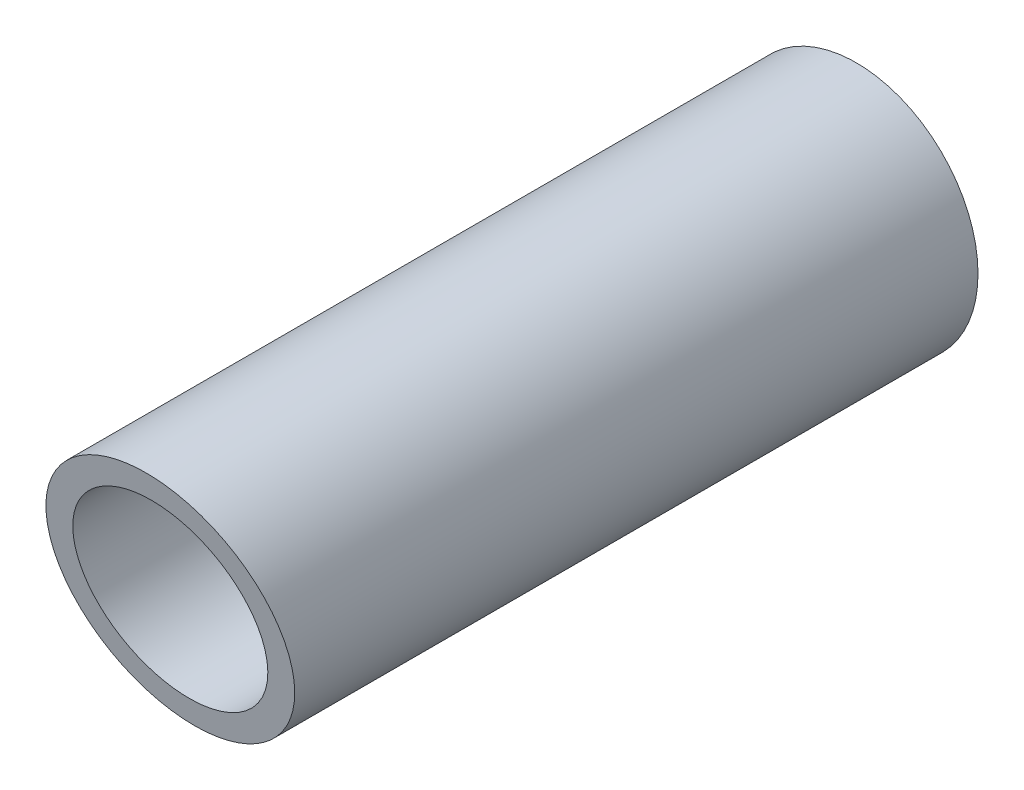
ISO-10303-21;
HEADER;
FILE_DESCRIPTION(('STEP AP214'),'2;1');
FILE_NAME('part.step','',(''),(''),'','','');
FILE_SCHEMA(('AUTOMOTIVE_DESIGN { 1 0 10303 214 1 1 1 1 }'));
ENDSEC;
DATA;
#1=APPLICATION_CONTEXT('core data for automotive mechanical design processes');
#2=APPLICATION_PROTOCOL_DEFINITION('international standard','automotive_design',2000,#1);
#3=PRODUCT_CONTEXT('',#1,'mechanical');
#4=PRODUCT('Part','Part','',(#3));
#5=PRODUCT_RELATED_PRODUCT_CATEGORY('part','',(#4));
#6=PRODUCT_DEFINITION_FORMATION('','',#4);
#7=PRODUCT_DEFINITION_CONTEXT('part definition',#1,'design');
#8=PRODUCT_DEFINITION('design','',#6,#7);
#9=PRODUCT_DEFINITION_SHAPE('','',#8);
#10=(LENGTH_UNIT() NAMED_UNIT(*) SI_UNIT(.MILLI.,.METRE.));
#11=(NAMED_UNIT(*) PLANE_ANGLE_UNIT() SI_UNIT($,.RADIAN.));
#12=(NAMED_UNIT(*) SI_UNIT($,.STERADIAN.) SOLID_ANGLE_UNIT());
#13=UNCERTAINTY_MEASURE_WITH_UNIT(LENGTH_MEASURE(1.E-05),#10,'distance_accuracy_value','');
#14=(GEOMETRIC_REPRESENTATION_CONTEXT(3) GLOBAL_UNCERTAINTY_ASSIGNED_CONTEXT((#13)) GLOBAL_UNIT_ASSIGNED_CONTEXT((#10,
#11,#12)) REPRESENTATION_CONTEXT('',''));
#15=CARTESIAN_POINT('',(0.,0.,0.));
#16=DIRECTION('',(0.,0.,1.));
#17=DIRECTION('',(1.,0.,0.));
#18=AXIS2_PLACEMENT_3D('',#15,#16,#17);
#19=CARTESIAN_POINT('',(0.,0.,0.));
#20=DIRECTION('',(0.,0.,1.));
#21=DIRECTION('',(1.,0.,0.));
#22=AXIS2_PLACEMENT_3D('',#19,#20,#21);
#23=PLANE('',#22);
#24=CARTESIAN_POINT('',(0.,0.,0.));
#25=DIRECTION('',(0.,0.,-1.));
#26=DIRECTION('',(-1.,0.,0.));
#27=AXIS2_PLACEMENT_3D('',#24,#25,#26);
#28=CIRCLE('',#27,10.65);
#29=CARTESIAN_POINT('',(10.65,0.,0.));
#30=VERTEX_POINT('',#29);
#31=EDGE_CURVE('E11',#30,#30,#28,.T.);
#32=ORIENTED_EDGE('',*,*,#31,.T.);
#33=EDGE_LOOP('',(#32));
#34=FACE_BOUND('',#33,.T.);
#35=CARTESIAN_POINT('',(0.,0.,0.));
#36=DIRECTION('',(0.,0.,1.));
#37=DIRECTION('',(-1.,0.,0.));
#38=AXIS2_PLACEMENT_3D('',#35,#36,#37);
#39=CIRCLE('',#38,8.35);
#40=CARTESIAN_POINT('',(8.35,0.,0.));
#41=VERTEX_POINT('',#40);
#42=EDGE_CURVE('E25',#41,#41,#39,.T.);
#43=ORIENTED_EDGE('',*,*,#42,.T.);
#44=EDGE_LOOP('',(#43));
#45=FACE_BOUND('',#44,.T.);
#46=ADVANCED_FACE('F16',(#34,#45),#23,.F.);
#47=CARTESIAN_POINT('',(0.,0.,0.));
#48=DIRECTION('',(0.,0.,1.));
#49=DIRECTION('',(-1.,0.,0.));
#50=AXIS2_PLACEMENT_3D('',#47,#48,#49);
#51=CYLINDRICAL_SURFACE('',#50,10.65);
#52=ORIENTED_EDGE('',*,*,#31,.F.);
#53=EDGE_LOOP('',(#52));
#54=FACE_BOUND('',#53,.T.);
#55=CARTESIAN_POINT('',(0.,0.,60.));
#56=DIRECTION('',(-0.00194935152591833,0.196301084394417,-0.980541730011632));
#57=DIRECTION('',(-0.00973670769507524,0.980493386422094,0.196310763092082));
#58=AXIS2_PLACEMENT_3D('',#55,#56,#57);
#59=ELLIPSE('',#58,10.8613429434295,10.65);
#60=CARTESIAN_POINT('',(0.10575372141614,-10.6494749236949,57.8678014785706));
#61=VERTEX_POINT('',#60);
#62=EDGE_CURVE('E54',#61,#61,#59,.T.);
#63=ORIENTED_EDGE('',*,*,#62,.T.);
#64=EDGE_LOOP('',(#63));
#65=FACE_BOUND('',#64,.T.);
#66=ADVANCED_FACE('F18',(#54,#65),#51,.T.);
#67=CARTESIAN_POINT('',(0.,0.,0.));
#68=DIRECTION('',(0.,0.,1.));
#69=DIRECTION('',(-1.,0.,0.));
#70=AXIS2_PLACEMENT_3D('',#67,#68,#69);
#71=CYLINDRICAL_SURFACE('',#70,8.35);
#72=ORIENTED_EDGE('',*,*,#42,.F.);
#73=EDGE_LOOP('',(#72));
#74=FACE_BOUND('',#73,.T.);
#75=CARTESIAN_POINT('',(0.,0.,60.));
#76=DIRECTION('',(0.00194935152591833,-0.196301084394417,0.980541730011632));
#77=DIRECTION('',(-0.00973670769507524,0.980493386422094,0.196310763092082));
#78=AXIS2_PLACEMENT_3D('',#75,#76,#77);
#79=ELLIPSE('',#78,8.51570080541187,8.35);
#80=CARTESIAN_POINT('',(0.0829148895610131,-8.34958832045563,58.3282762766257));
#81=VERTEX_POINT('',#80);
#82=EDGE_CURVE('E50',#81,#81,#79,.T.);
#83=ORIENTED_EDGE('',*,*,#82,.T.);
#84=EDGE_LOOP('',(#83));
#85=FACE_BOUND('',#84,.T.);
#86=ADVANCED_FACE('F51',(#74,#85),#71,.F.);
#87=CARTESIAN_POINT('',(0.114685231057487,-11.5488842937157,57.6877250576523));
#88=DIRECTION('',(-0.00194935152591833,0.196301084394417,-0.980541730011632));
#89=DIRECTION('',(-0.999998023863775,0.,0.00198803132398153));
#90=AXIS2_PLACEMENT_3D('',#87,#88,#89);
#91=PLANE('',#90);
#92=ORIENTED_EDGE('',*,*,#62,.F.);
#93=EDGE_LOOP('',(#92));
#94=FACE_BOUND('',#93,.T.);
#95=ORIENTED_EDGE('',*,*,#82,.F.);
#96=EDGE_LOOP('',(#95));
#97=FACE_BOUND('',#96,.T.);
#98=ADVANCED_FACE('F77',(#94,#97),#91,.F.);
#99=CLOSED_SHELL('',(#46,#66,#86,#98));
#100=MANIFOLD_SOLID_BREP('B1',#99);
#101=ADVANCED_BREP_SHAPE_REPRESENTATION('',(#18,#100),#14);
#102=SHAPE_DEFINITION_REPRESENTATION(#9,#101);
ENDSEC;
END-ISO-10303-21;
